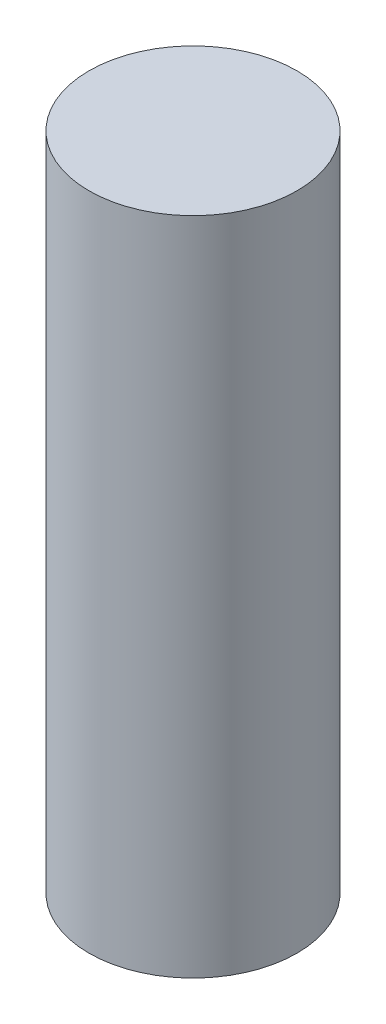
ISO-10303-21;
HEADER;
FILE_DESCRIPTION(('STEP AP214'),'2;1');
FILE_NAME('part.step','',(''),(''),'','','');
FILE_SCHEMA(('AUTOMOTIVE_DESIGN { 1 0 10303 214 1 1 1 1 }'));
ENDSEC;
DATA;
#1=APPLICATION_CONTEXT('core data for automotive mechanical design processes');
#2=APPLICATION_PROTOCOL_DEFINITION('international standard','automotive_design',2000,#1);
#3=PRODUCT_CONTEXT('',#1,'mechanical');
#4=PRODUCT('Part','Part','',(#3));
#5=PRODUCT_RELATED_PRODUCT_CATEGORY('part','',(#4));
#6=PRODUCT_DEFINITION_FORMATION('','',#4);
#7=PRODUCT_DEFINITION_CONTEXT('part definition',#1,'design');
#8=PRODUCT_DEFINITION('design','',#6,#7);
#9=PRODUCT_DEFINITION_SHAPE('','',#8);
#10=(LENGTH_UNIT() NAMED_UNIT(*) SI_UNIT(.MILLI.,.METRE.));
#11=(NAMED_UNIT(*) PLANE_ANGLE_UNIT() SI_UNIT($,.RADIAN.));
#12=(NAMED_UNIT(*) SI_UNIT($,.STERADIAN.) SOLID_ANGLE_UNIT());
#13=UNCERTAINTY_MEASURE_WITH_UNIT(LENGTH_MEASURE(1.E-05),#10,'distance_accuracy_value','');
#14=(GEOMETRIC_REPRESENTATION_CONTEXT(3) GLOBAL_UNCERTAINTY_ASSIGNED_CONTEXT((#13)) GLOBAL_UNIT_ASSIGNED_CONTEXT((#10,
#11,#12)) REPRESENTATION_CONTEXT('',''));
#15=CARTESIAN_POINT('',(0.,0.,0.));
#16=DIRECTION('',(0.,0.,1.));
#17=DIRECTION('',(1.,0.,0.));
#18=AXIS2_PLACEMENT_3D('',#15,#16,#17);
#19=CARTESIAN_POINT('',(0.,12.7,0.));
#20=DIRECTION('',(0.,-1.,0.));
#21=DIRECTION('',(0.,0.,-1.));
#22=AXIS2_PLACEMENT_3D('',#19,#20,#21);
#23=CYLINDRICAL_SURFACE('',#22,2.);
#24=CARTESIAN_POINT('',(0.,12.7,0.));
#25=DIRECTION('',(0.,1.,0.));
#26=DIRECTION('',(0.,0.,1.));
#27=AXIS2_PLACEMENT_3D('',#24,#25,#26);
#28=CIRCLE('',#27,2.);
#29=CARTESIAN_POINT('',(0.,12.7,2.));
#30=VERTEX_POINT('',#29);
#31=EDGE_CURVE('E10',#30,#30,#28,.T.);
#32=ORIENTED_EDGE('',*,*,#31,.F.);
#33=EDGE_LOOP('',(#32));
#34=FACE_BOUND('',#33,.T.);
#35=CARTESIAN_POINT('',(0.,0.,0.));
#36=DIRECTION('',(0.,1.,0.));
#37=DIRECTION('',(0.,0.,1.));
#38=AXIS2_PLACEMENT_3D('',#35,#36,#37);
#39=CIRCLE('',#38,2.);
#40=CARTESIAN_POINT('',(0.,0.,2.));
#41=VERTEX_POINT('',#40);
#42=EDGE_CURVE('E34',#41,#41,#39,.T.);
#43=ORIENTED_EDGE('',*,*,#42,.T.);
#44=EDGE_LOOP('',(#43));
#45=FACE_BOUND('',#44,.T.);
#46=ADVANCED_FACE('F31',(#34,#45),#23,.T.);
#47=CARTESIAN_POINT('',(0.,12.7,0.));
#48=DIRECTION('',(0.,1.,0.));
#49=DIRECTION('',(0.,0.,1.));
#50=AXIS2_PLACEMENT_3D('',#47,#48,#49);
#51=PLANE('',#50);
#52=ORIENTED_EDGE('',*,*,#31,.T.);
#53=EDGE_LOOP('',(#52));
#54=FACE_BOUND('',#53,.T.);
#55=ADVANCED_FACE('F46',(#54),#51,.T.);
#56=CARTESIAN_POINT('',(0.,0.,0.));
#57=DIRECTION('',(0.,1.,0.));
#58=DIRECTION('',(0.,0.,1.));
#59=AXIS2_PLACEMENT_3D('',#56,#57,#58);
#60=PLANE('',#59);
#61=ORIENTED_EDGE('',*,*,#42,.F.);
#62=EDGE_LOOP('',(#61));
#63=FACE_BOUND('',#62,.T.);
#64=ADVANCED_FACE('F44',(#63),#60,.F.);
#65=CLOSED_SHELL('',(#46,#55,#64));
#66=MANIFOLD_SOLID_BREP('B2',#65);
#67=ADVANCED_BREP_SHAPE_REPRESENTATION('',(#18,#66),#14);
#68=SHAPE_DEFINITION_REPRESENTATION(#9,#67);
ENDSEC;
END-ISO-10303-21;
